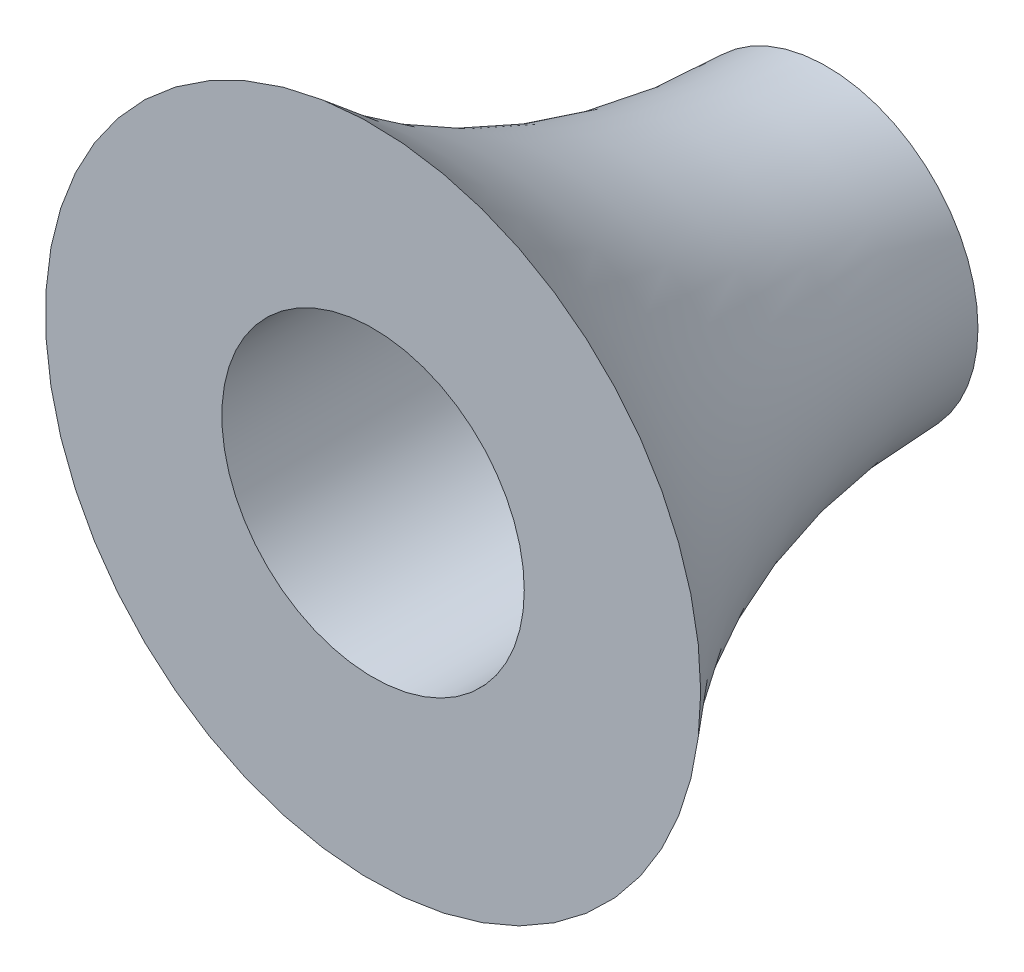
ISO-10303-21;
HEADER;
FILE_DESCRIPTION(('STEP AP214'),'2;1');
FILE_NAME('part.step','',(''),(''),'','','');
FILE_SCHEMA(('AUTOMOTIVE_DESIGN { 1 0 10303 214 1 1 1 1 }'));
ENDSEC;
DATA;
#1=APPLICATION_CONTEXT('core data for automotive mechanical design processes');
#2=APPLICATION_PROTOCOL_DEFINITION('international standard','automotive_design',2000,#1);
#3=PRODUCT_CONTEXT('',#1,'mechanical');
#4=PRODUCT('Part','Part','',(#3));
#5=PRODUCT_RELATED_PRODUCT_CATEGORY('part','',(#4));
#6=PRODUCT_DEFINITION_FORMATION('','',#4);
#7=PRODUCT_DEFINITION_CONTEXT('part definition',#1,'design');
#8=PRODUCT_DEFINITION('design','',#6,#7);
#9=PRODUCT_DEFINITION_SHAPE('','',#8);
#10=(LENGTH_UNIT() NAMED_UNIT(*) SI_UNIT(.MILLI.,.METRE.));
#11=(NAMED_UNIT(*) PLANE_ANGLE_UNIT() SI_UNIT($,.RADIAN.));
#12=(NAMED_UNIT(*) SI_UNIT($,.STERADIAN.) SOLID_ANGLE_UNIT());
#13=UNCERTAINTY_MEASURE_WITH_UNIT(LENGTH_MEASURE(1.E-05),#10,'distance_accuracy_value','');
#14=(GEOMETRIC_REPRESENTATION_CONTEXT(3) GLOBAL_UNCERTAINTY_ASSIGNED_CONTEXT((#13)) GLOBAL_UNIT_ASSIGNED_CONTEXT((#10,
#11,#12)) REPRESENTATION_CONTEXT('',''));
#15=CARTESIAN_POINT('',(0.,0.,0.));
#16=DIRECTION('',(0.,0.,1.));
#17=DIRECTION('',(1.,0.,0.));
#18=AXIS2_PLACEMENT_3D('',#15,#16,#17);
#19=CARTESIAN_POINT('',(-2.10805526532028,3.31694473467972,-7.02));
#20=DIRECTION('',(0.,0.,1.));
#21=DIRECTION('',(1.,0.,0.));
#22=AXIS2_PLACEMENT_3D('',#19,#20,#21);
#23=PLANE('',#22);
#24=CARTESIAN_POINT('',(-1.225,4.2,-7.02));
#25=DIRECTION('',(0.,0.,1.));
#26=DIRECTION('',(1.,0.,0.));
#27=AXIS2_PLACEMENT_3D('',#24,#25,#26);
#28=CIRCLE('',#27,0.299999999999998);
#29=CARTESIAN_POINT('',(-0.925000000000002,4.2,-7.02));
#30=VERTEX_POINT('',#29);
#31=EDGE_CURVE('E19',#30,#30,#28,.T.);
#32=ORIENTED_EDGE('',*,*,#31,.F.);
#33=EDGE_LOOP('',(#32));
#34=FACE_BOUND('',#33,.T.);
#35=CARTESIAN_POINT('',(-1.225,4.2,-7.01999999999981));
#36=DIRECTION('',(0.,0.,1.));
#37=DIRECTION('',(1.,0.,0.));
#38=AXIS2_PLACEMENT_3D('',#35,#36,#37);
#39=CIRCLE('',#38,0.650000000001198);
#40=CARTESIAN_POINT('',(-0.574999999998802,4.2,-7.01999999999981));
#41=VERTEX_POINT('',#40);
#42=EDGE_CURVE('E23',#41,#41,#39,.F.);
#43=ORIENTED_EDGE('',*,*,#42,.F.);
#44=EDGE_LOOP('',(#43));
#45=FACE_BOUND('',#44,.T.);
#46=ADVANCED_FACE('F15',(#34,#45),#23,.T.);
#47=CARTESIAN_POINT('',(-1.225,4.2,-7.92));
#48=DIRECTION('',(0.,0.,1.));
#49=DIRECTION('',(1.,0.,0.));
#50=AXIS2_PLACEMENT_3D('',#47,#48,#49);
#51=CYLINDRICAL_SURFACE('',#50,0.299999999999998);
#52=ORIENTED_EDGE('',*,*,#31,.T.);
#53=EDGE_LOOP('',(#52));
#54=FACE_BOUND('',#53,.T.);
#55=CARTESIAN_POINT('',(-1.225,4.2,-7.92));
#56=DIRECTION('',(0.,0.,1.));
#57=DIRECTION('',(1.,0.,0.));
#58=AXIS2_PLACEMENT_3D('',#55,#56,#57);
#59=CIRCLE('',#58,0.299999999999998);
#60=CARTESIAN_POINT('',(-0.925000000000002,4.2,-7.92));
#61=VERTEX_POINT('',#60);
#62=EDGE_CURVE('E10',#61,#61,#59,.T.);
#63=ORIENTED_EDGE('',*,*,#62,.F.);
#64=EDGE_LOOP('',(#63));
#65=FACE_BOUND('',#64,.T.);
#66=ADVANCED_FACE('F33',(#54,#65),#51,.F.);
#67=CARTESIAN_POINT('',(-1.225,4.2,-7.92));
#68=DIRECTION('',(0.,0.,1.));
#69=DIRECTION('',(1.,0.,0.));
#70=AXIS2_PLACEMENT_3D('',#67,#68,#69);
#71=TOROIDAL_SURFACE('',#70,1.63214285713998,1.33214285713999);
#72=ORIENTED_EDGE('',*,*,#62,.T.);
#73=EDGE_LOOP('',(#72));
#74=FACE_BOUND('',#73,.T.);
#75=ORIENTED_EDGE('',*,*,#42,.T.);
#76=EDGE_LOOP('',(#75));
#77=FACE_BOUND('',#76,.T.);
#78=ADVANCED_FACE('F17',(#74,#77),#71,.F.);
#79=CLOSED_SHELL('',(#46,#66,#78));
#80=MANIFOLD_SOLID_BREP('B1',#79);
#81=ADVANCED_BREP_SHAPE_REPRESENTATION('',(#18,#80),#14);
#82=SHAPE_DEFINITION_REPRESENTATION(#9,#81);
ENDSEC;
END-ISO-10303-21;
